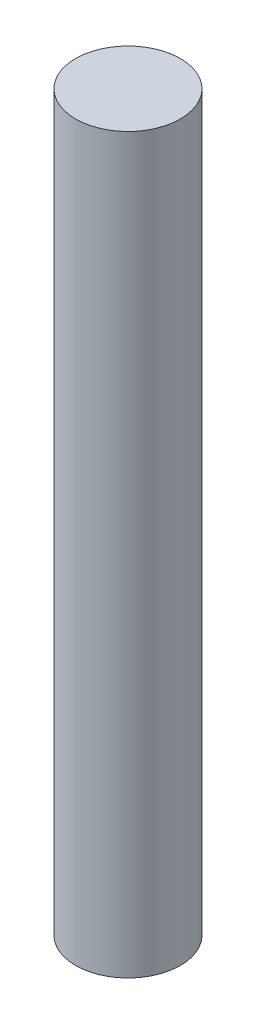
ISO-10303-21;
HEADER;
FILE_DESCRIPTION(('STEP AP214'),'2;1');
FILE_NAME('part.step','',(''),(''),'','','');
FILE_SCHEMA(('AUTOMOTIVE_DESIGN { 1 0 10303 214 1 1 1 1 }'));
ENDSEC;
DATA;
#1=APPLICATION_CONTEXT('core data for automotive mechanical design processes');
#2=APPLICATION_PROTOCOL_DEFINITION('international standard','automotive_design',2000,#1);
#3=PRODUCT_CONTEXT('',#1,'mechanical');
#4=PRODUCT('Part','Part','',(#3));
#5=PRODUCT_RELATED_PRODUCT_CATEGORY('part','',(#4));
#6=PRODUCT_DEFINITION_FORMATION('','',#4);
#7=PRODUCT_DEFINITION_CONTEXT('part definition',#1,'design');
#8=PRODUCT_DEFINITION('design','',#6,#7);
#9=PRODUCT_DEFINITION_SHAPE('','',#8);
#10=(LENGTH_UNIT() NAMED_UNIT(*) SI_UNIT(.MILLI.,.METRE.));
#11=(NAMED_UNIT(*) PLANE_ANGLE_UNIT() SI_UNIT($,.RADIAN.));
#12=(NAMED_UNIT(*) SI_UNIT($,.STERADIAN.) SOLID_ANGLE_UNIT());
#13=UNCERTAINTY_MEASURE_WITH_UNIT(LENGTH_MEASURE(1.E-05),#10,'distance_accuracy_value','');
#14=(GEOMETRIC_REPRESENTATION_CONTEXT(3) GLOBAL_UNCERTAINTY_ASSIGNED_CONTEXT((#13)) GLOBAL_UNIT_ASSIGNED_CONTEXT((#10,
#11,#12)) REPRESENTATION_CONTEXT('',''));
#15=CARTESIAN_POINT('',(0.,0.,0.));
#16=DIRECTION('',(0.,0.,1.));
#17=DIRECTION('',(1.,0.,0.));
#18=AXIS2_PLACEMENT_3D('',#15,#16,#17);
#19=CARTESIAN_POINT('',(0.,22.225,0.));
#20=DIRECTION('',(0.,-1.,0.));
#21=DIRECTION('',(0.,0.,-1.));
#22=AXIS2_PLACEMENT_3D('',#19,#20,#21);
#23=CYLINDRICAL_SURFACE('',#22,1.5875);
#24=CARTESIAN_POINT('',(0.,22.225,0.));
#25=DIRECTION('',(0.,1.,0.));
#26=DIRECTION('',(0.,0.,1.));
#27=AXIS2_PLACEMENT_3D('',#24,#25,#26);
#28=CIRCLE('',#27,1.5875);
#29=CARTESIAN_POINT('',(0.,22.225,1.5875));
#30=VERTEX_POINT('',#29);
#31=EDGE_CURVE('E10',#30,#30,#28,.T.);
#32=ORIENTED_EDGE('',*,*,#31,.F.);
#33=EDGE_LOOP('',(#32));
#34=FACE_BOUND('',#33,.T.);
#35=CARTESIAN_POINT('',(0.,0.,0.));
#36=DIRECTION('',(0.,1.,0.));
#37=DIRECTION('',(0.,0.,1.));
#38=AXIS2_PLACEMENT_3D('',#35,#36,#37);
#39=CIRCLE('',#38,1.5875);
#40=CARTESIAN_POINT('',(0.,0.,1.5875));
#41=VERTEX_POINT('',#40);
#42=EDGE_CURVE('E42',#41,#41,#39,.T.);
#43=ORIENTED_EDGE('',*,*,#42,.T.);
#44=EDGE_LOOP('',(#43));
#45=FACE_BOUND('',#44,.T.);
#46=ADVANCED_FACE('F39',(#34,#45),#23,.T.);
#47=CARTESIAN_POINT('',(0.,22.225,0.));
#48=DIRECTION('',(0.,1.,0.));
#49=DIRECTION('',(0.,0.,1.));
#50=AXIS2_PLACEMENT_3D('',#47,#48,#49);
#51=PLANE('',#50);
#52=ORIENTED_EDGE('',*,*,#31,.T.);
#53=EDGE_LOOP('',(#52));
#54=FACE_BOUND('',#53,.T.);
#55=ADVANCED_FACE('F56',(#54),#51,.T.);
#56=CARTESIAN_POINT('',(0.,0.,0.));
#57=DIRECTION('',(0.,1.,0.));
#58=DIRECTION('',(0.,0.,1.));
#59=AXIS2_PLACEMENT_3D('',#56,#57,#58);
#60=PLANE('',#59);
#61=ORIENTED_EDGE('',*,*,#42,.F.);
#62=EDGE_LOOP('',(#61));
#63=FACE_BOUND('',#62,.T.);
#64=ADVANCED_FACE('F54',(#63),#60,.F.);
#65=CLOSED_SHELL('',(#46,#55,#64));
#66=MANIFOLD_SOLID_BREP('B2',#65);
#67=ADVANCED_BREP_SHAPE_REPRESENTATION('',(#18,#66),#14);
#68=SHAPE_DEFINITION_REPRESENTATION(#9,#67);
ENDSEC;
END-ISO-10303-21;
